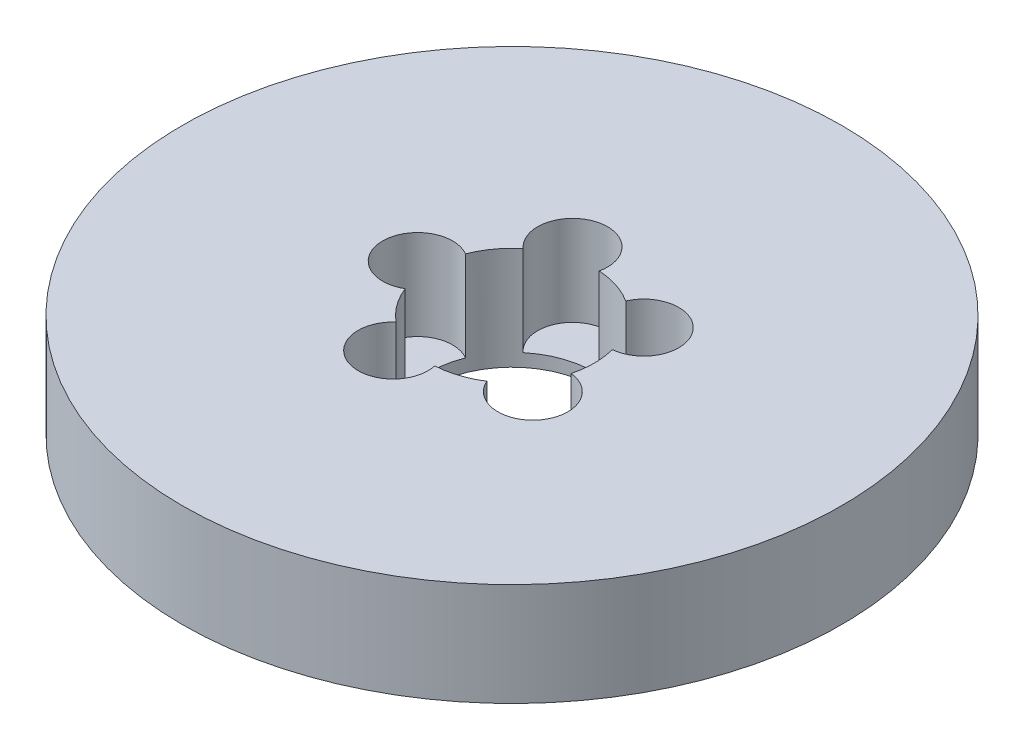
ISO-10303-21;
HEADER;
FILE_DESCRIPTION(('STEP AP214'),'2;1');
FILE_NAME('part.step','',(''),(''),'','','');
FILE_SCHEMA(('AUTOMOTIVE_DESIGN { 1 0 10303 214 1 1 1 1 }'));
ENDSEC;
DATA;
#1=APPLICATION_CONTEXT('core data for automotive mechanical design processes');
#2=APPLICATION_PROTOCOL_DEFINITION('international standard','automotive_design',2000,#1);
#3=PRODUCT_CONTEXT('',#1,'mechanical');
#4=PRODUCT('Part','Part','',(#3));
#5=PRODUCT_RELATED_PRODUCT_CATEGORY('part','',(#4));
#6=PRODUCT_DEFINITION_FORMATION('','',#4);
#7=PRODUCT_DEFINITION_CONTEXT('part definition',#1,'design');
#8=PRODUCT_DEFINITION('design','',#6,#7);
#9=PRODUCT_DEFINITION_SHAPE('','',#8);
#10=(LENGTH_UNIT() NAMED_UNIT(*) SI_UNIT(.MILLI.,.METRE.));
#11=(NAMED_UNIT(*) PLANE_ANGLE_UNIT() SI_UNIT($,.RADIAN.));
#12=(NAMED_UNIT(*) SI_UNIT($,.STERADIAN.) SOLID_ANGLE_UNIT());
#13=UNCERTAINTY_MEASURE_WITH_UNIT(LENGTH_MEASURE(1.E-05),#10,'distance_accuracy_value','');
#14=(GEOMETRIC_REPRESENTATION_CONTEXT(3) GLOBAL_UNCERTAINTY_ASSIGNED_CONTEXT((#13)) GLOBAL_UNIT_ASSIGNED_CONTEXT((#10,
#11,#12)) REPRESENTATION_CONTEXT('',''));
#15=CARTESIAN_POINT('',(0.,0.,0.));
#16=DIRECTION('',(0.,0.,1.));
#17=DIRECTION('',(1.,0.,0.));
#18=AXIS2_PLACEMENT_3D('',#15,#16,#17);
#19=CARTESIAN_POINT('',(0.,25.,0.));
#20=DIRECTION('',(0.,-1.,0.));
#21=DIRECTION('',(0.,0.,-1.));
#22=AXIS2_PLACEMENT_3D('',#19,#20,#21);
#23=CYLINDRICAL_SURFACE('',#22,80.);
#24=CARTESIAN_POINT('',(0.,25.,0.));
#25=DIRECTION('',(0.,1.,0.));
#26=DIRECTION('',(0.,0.,1.));
#27=AXIS2_PLACEMENT_3D('',#24,#25,#26);
#28=CIRCLE('',#27,80.);
#29=CARTESIAN_POINT('',(0.,25.,80.));
#30=VERTEX_POINT('',#29);
#31=EDGE_CURVE('E157',#30,#30,#28,.T.);
#32=ORIENTED_EDGE('',*,*,#31,.F.);
#33=EDGE_LOOP('',(#32));
#34=FACE_BOUND('',#33,.T.);
#35=CARTESIAN_POINT('',(0.,0.,0.));
#36=DIRECTION('',(0.,1.,0.));
#37=DIRECTION('',(0.,0.,1.));
#38=AXIS2_PLACEMENT_3D('',#35,#36,#37);
#39=CIRCLE('',#38,80.);
#40=CARTESIAN_POINT('',(0.,0.,80.));
#41=VERTEX_POINT('',#40);
#42=EDGE_CURVE('E150',#41,#41,#39,.T.);
#43=ORIENTED_EDGE('',*,*,#42,.T.);
#44=EDGE_LOOP('',(#43));
#45=FACE_BOUND('',#44,.T.);
#46=ADVANCED_FACE('F39',(#34,#45),#23,.T.);
#47=CARTESIAN_POINT('',(0.,25.,0.));
#48=DIRECTION('',(0.,1.,0.));
#49=DIRECTION('',(0.,0.,1.));
#50=AXIS2_PLACEMENT_3D('',#47,#48,#49);
#51=PLANE('',#50);
#52=CARTESIAN_POINT('',(-7.07870051810145,25.,-21.7860000491539));
#53=DIRECTION('',(0.,1.,0.));
#54=DIRECTION('',(-0.95105651629515,0.,0.309016994374958));
#55=AXIS2_PLACEMENT_3D('',#52,#53,#54);
#56=CIRCLE('',#55,8.48917629598896);
#57=CARTESIAN_POINT('',(1.21247338873536,25.,-19.9632138765683));
#58=VERTEX_POINT('',#57);
#59=CARTESIAN_POINT('',(-12.7149942817219,25.,-15.4379053117895));
#60=VERTEX_POINT('',#59);
#61=EDGE_CURVE('E194',#58,#60,#56,.T.);
#62=ORIENTED_EDGE('',*,*,#61,.F.);
#63=CARTESIAN_POINT('',(0.,25.,0.));
#64=DIRECTION('',(0.,1.,0.));
#65=DIRECTION('',(0.,0.,1.));
#66=AXIS2_PLACEMENT_3D('',#63,#64,#65);
#67=CIRCLE('',#66,20.);
#68=CARTESIAN_POINT('',(10.7531711282927,25.,-16.8632532651815));
#69=VERTEX_POINT('',#68);
#70=EDGE_CURVE('E147',#69,#58,#67,.T.);
#71=ORIENTED_EDGE('',*,*,#70,.F.);
#72=CARTESIAN_POINT('',(18.5322785525703,25.,-13.4644885092842));
#73=DIRECTION('',(0.,1.,0.));
#74=DIRECTION('',(-0.58778525229248,0.,-0.809016994374942));
#75=AXIS2_PLACEMENT_3D('',#72,#73,#74);
#76=CIRCLE('',#75,8.48917629598896);
#77=CARTESIAN_POINT('',(19.3608195258507,25.,-5.0158416330101));
#78=VERTEX_POINT('',#77);
#79=EDGE_CURVE('E254',#78,#69,#76,.T.);
#80=ORIENTED_EDGE('',*,*,#79,.F.);
#81=CARTESIAN_POINT('',(19.3608195258508,25.,5.01584163300982));
#82=VERTEX_POINT('',#81);
#83=EDGE_CURVE('E144',#82,#78,#67,.T.);
#84=ORIENTED_EDGE('',*,*,#83,.F.);
#85=CARTESIAN_POINT('',(18.5322785525705,25.,13.4644885092839));
#86=DIRECTION('',(0.,1.,0.));
#87=DIRECTION('',(0.587785252292469,0.,-0.809016994374951));
#88=AXIS2_PLACEMENT_3D('',#85,#86,#87);
#89=CIRCLE('',#88,8.48917629598896);
#90=CARTESIAN_POINT('',(10.7531711282929,25.,16.8632532651813));
#91=VERTEX_POINT('',#90);
#92=EDGE_CURVE('E141',#91,#82,#89,.T.);
#93=ORIENTED_EDGE('',*,*,#92,.F.);
#94=CARTESIAN_POINT('',(1.21247338873564,25.,19.9632138765683));
#95=VERTEX_POINT('',#94);
#96=EDGE_CURVE('E134',#95,#91,#67,.T.);
#97=ORIENTED_EDGE('',*,*,#96,.F.);
#98=CARTESIAN_POINT('',(-7.07870051810114,25.,21.786000049154));
#99=DIRECTION('',(0.,1.,0.));
#100=DIRECTION('',(0.951056516295155,0.,0.309016994374945));
#101=AXIS2_PLACEMENT_3D('',#98,#99,#100);
#102=CIRCLE('',#101,8.48917629598896);
#103=CARTESIAN_POINT('',(-12.7149942817217,25.,15.4379053117897));
#104=VERTEX_POINT('',#103);
#105=EDGE_CURVE('E111',#104,#95,#102,.T.);
#106=ORIENTED_EDGE('',*,*,#105,.F.);
#107=CARTESIAN_POINT('',(-18.6114697611574,25.,7.32210306739282));
#108=VERTEX_POINT('',#107);
#109=EDGE_CURVE('E145',#108,#104,#67,.T.);
#110=ORIENTED_EDGE('',*,*,#109,.F.);
#111=CARTESIAN_POINT('',(-22.9071560689385,25.,0.));
#112=DIRECTION('',(0.,1.,0.));
#113=DIRECTION('',(0.,0.,1.));
#114=AXIS2_PLACEMENT_3D('',#111,#112,#113);
#115=CIRCLE('',#114,8.48917629598896);
#116=CARTESIAN_POINT('',(-18.6114697611574,25.,-7.32210306739282));
#117=VERTEX_POINT('',#116);
#118=EDGE_CURVE('E153',#117,#108,#115,.T.);
#119=ORIENTED_EDGE('',*,*,#118,.F.);
#120=EDGE_CURVE('E146',#60,#117,#67,.T.);
#121=ORIENTED_EDGE('',*,*,#120,.F.);
#122=EDGE_LOOP('',(#62,#71,#80,#84,#93,#97,#106,#110,#119,#121));
#123=FACE_BOUND('',#122,.T.);
#124=ORIENTED_EDGE('',*,*,#31,.T.);
#125=EDGE_LOOP('',(#124));
#126=FACE_BOUND('',#125,.T.);
#127=ADVANCED_FACE('F139',(#123,#126),#51,.T.);
#128=CARTESIAN_POINT('',(0.,0.,0.));
#129=DIRECTION('',(0.,1.,0.));
#130=DIRECTION('',(0.,0.,1.));
#131=AXIS2_PLACEMENT_3D('',#128,#129,#130);
#132=PLANE('',#131);
#133=CARTESIAN_POINT('',(0.,0.,0.));
#134=DIRECTION('',(0.,1.,0.));
#135=DIRECTION('',(0.,0.,1.));
#136=AXIS2_PLACEMENT_3D('',#133,#134,#135);
#137=CIRCLE('',#136,20.);
#138=CARTESIAN_POINT('',(0.,0.,20.));
#139=VERTEX_POINT('',#138);
#140=EDGE_CURVE('E154',#139,#139,#137,.T.);
#141=ORIENTED_EDGE('',*,*,#140,.T.);
#142=EDGE_LOOP('',(#141));
#143=FACE_BOUND('',#142,.T.);
#144=ORIENTED_EDGE('',*,*,#42,.F.);
#145=EDGE_LOOP('',(#144));
#146=FACE_BOUND('',#145,.T.);
#147=ADVANCED_FACE('F213',(#143,#146),#132,.F.);
#148=CARTESIAN_POINT('',(0.,25.,0.));
#149=DIRECTION('',(0.,-1.,0.));
#150=DIRECTION('',(0.,0.,-1.));
#151=AXIS2_PLACEMENT_3D('',#148,#149,#150);
#152=CYLINDRICAL_SURFACE('',#151,20.);
#153=DIRECTION('',(0.,1.,0.));
#154=VECTOR('',#153,1.);
#155=CARTESIAN_POINT('',(1.21247338873536,14.0648096940032,-19.9632138765683));
#156=LINE('',#155,#154);
#157=CARTESIAN_POINT('',(1.21247338873536,3.12961938800646,-19.9632138765683));
#158=VERTEX_POINT('',#157);
#159=EDGE_CURVE('E11',#158,#58,#156,.T.);
#160=ORIENTED_EDGE('',*,*,#159,.F.);
#161=CARTESIAN_POINT('',(0.,3.12961938800646,0.));
#162=DIRECTION('',(0.,1.,0.));
#163=DIRECTION('',(0.,0.,1.));
#164=AXIS2_PLACEMENT_3D('',#161,#162,#163);
#165=CIRCLE('',#164,20.);
#166=CARTESIAN_POINT('',(-12.7149942817219,3.12961938800646,-15.4379053117895));
#167=VERTEX_POINT('',#166);
#168=EDGE_CURVE('E189',#158,#167,#165,.T.);
#169=ORIENTED_EDGE('',*,*,#168,.T.);
#170=DIRECTION('',(0.,1.,0.));
#171=VECTOR('',#170,1.);
#172=CARTESIAN_POINT('',(-12.7149942817219,14.0648096940032,-15.4379053117895));
#173=LINE('',#172,#171);
#174=EDGE_CURVE('E46',#60,#167,#173,.F.);
#175=ORIENTED_EDGE('',*,*,#174,.F.);
#176=ORIENTED_EDGE('',*,*,#120,.T.);
#177=DIRECTION('',(0.,1.,0.));
#178=VECTOR('',#177,1.);
#179=CARTESIAN_POINT('',(-18.6114697611574,14.0648096940032,-7.32210306739282));
#180=LINE('',#179,#178);
#181=CARTESIAN_POINT('',(-18.6114697611574,3.12961938800646,-7.32210306739282));
#182=VERTEX_POINT('',#181);
#183=EDGE_CURVE('E168',#182,#117,#180,.T.);
#184=ORIENTED_EDGE('',*,*,#183,.F.);
#185=CARTESIAN_POINT('',(0.,3.12961938800646,0.));
#186=DIRECTION('',(0.,1.,0.));
#187=DIRECTION('',(0.,0.,1.));
#188=AXIS2_PLACEMENT_3D('',#185,#186,#187);
#189=CIRCLE('',#188,20.);
#190=CARTESIAN_POINT('',(-18.6114697611574,3.12961938800646,7.32210306739282));
#191=VERTEX_POINT('',#190);
#192=EDGE_CURVE('E165',#182,#191,#189,.T.);
#193=ORIENTED_EDGE('',*,*,#192,.T.);
#194=DIRECTION('',(0.,1.,0.));
#195=VECTOR('',#194,1.);
#196=CARTESIAN_POINT('',(-18.6114697611574,14.0648096940032,7.32210306739282));
#197=LINE('',#196,#195);
#198=EDGE_CURVE('E170',#108,#191,#197,.F.);
#199=ORIENTED_EDGE('',*,*,#198,.F.);
#200=ORIENTED_EDGE('',*,*,#109,.T.);
#201=DIRECTION('',(0.,1.,0.));
#202=VECTOR('',#201,1.);
#203=CARTESIAN_POINT('',(-12.7149942817217,14.0648096940032,15.4379053117897));
#204=LINE('',#203,#202);
#205=CARTESIAN_POINT('',(-12.7149942817217,3.12961938800646,15.4379053117897));
#206=VERTEX_POINT('',#205);
#207=EDGE_CURVE('E121',#206,#104,#204,.T.);
#208=ORIENTED_EDGE('',*,*,#207,.F.);
#209=CARTESIAN_POINT('',(0.,3.12961938800646,0.));
#210=DIRECTION('',(0.,1.,0.));
#211=DIRECTION('',(0.,0.,1.));
#212=AXIS2_PLACEMENT_3D('',#209,#210,#211);
#213=CIRCLE('',#212,20.);
#214=CARTESIAN_POINT('',(1.21247338873564,3.12961938800646,19.9632138765683));
#215=VERTEX_POINT('',#214);
#216=EDGE_CURVE('E136',#206,#215,#213,.T.);
#217=ORIENTED_EDGE('',*,*,#216,.T.);
#218=DIRECTION('',(0.,1.,0.));
#219=VECTOR('',#218,1.);
#220=CARTESIAN_POINT('',(1.21247338873564,14.0648096940032,19.9632138765683));
#221=LINE('',#220,#219);
#222=EDGE_CURVE('E117',#95,#215,#221,.F.);
#223=ORIENTED_EDGE('',*,*,#222,.F.);
#224=ORIENTED_EDGE('',*,*,#96,.T.);
#225=DIRECTION('',(0.,1.,0.));
#226=VECTOR('',#225,1.);
#227=CARTESIAN_POINT('',(10.7531711282929,14.0648096940032,16.8632532651813));
#228=LINE('',#227,#226);
#229=CARTESIAN_POINT('',(10.7531711282929,3.12961938800646,16.8632532651813));
#230=VERTEX_POINT('',#229);
#231=EDGE_CURVE('E182',#230,#91,#228,.T.);
#232=ORIENTED_EDGE('',*,*,#231,.F.);
#233=CARTESIAN_POINT('',(0.,3.12961938800646,0.));
#234=DIRECTION('',(0.,1.,0.));
#235=DIRECTION('',(0.,0.,1.));
#236=AXIS2_PLACEMENT_3D('',#233,#234,#235);
#237=CIRCLE('',#236,20.);
#238=CARTESIAN_POINT('',(19.3608195258508,3.12961938800646,5.01584163300982));
#239=VERTEX_POINT('',#238);
#240=EDGE_CURVE('E174',#230,#239,#237,.T.);
#241=ORIENTED_EDGE('',*,*,#240,.T.);
#242=DIRECTION('',(0.,1.,0.));
#243=VECTOR('',#242,1.);
#244=CARTESIAN_POINT('',(19.3608195258508,14.0648096940032,5.01584163300982));
#245=LINE('',#244,#243);
#246=EDGE_CURVE('E177',#82,#239,#245,.F.);
#247=ORIENTED_EDGE('',*,*,#246,.F.);
#248=ORIENTED_EDGE('',*,*,#83,.T.);
#249=DIRECTION('',(0.,1.,0.));
#250=VECTOR('',#249,1.);
#251=CARTESIAN_POINT('',(19.3608195258507,14.0648096940032,-5.0158416330101));
#252=LINE('',#251,#250);
#253=CARTESIAN_POINT('',(19.3608195258507,3.12961938800646,-5.0158416330101));
#254=VERTEX_POINT('',#253);
#255=EDGE_CURVE('E187',#254,#78,#252,.T.);
#256=ORIENTED_EDGE('',*,*,#255,.F.);
#257=CARTESIAN_POINT('',(0.,3.12961938800646,0.));
#258=DIRECTION('',(0.,1.,0.));
#259=DIRECTION('',(0.,0.,1.));
#260=AXIS2_PLACEMENT_3D('',#257,#258,#259);
#261=CIRCLE('',#260,20.);
#262=CARTESIAN_POINT('',(10.7531711282927,3.12961938800646,-16.8632532651815));
#263=VERTEX_POINT('',#262);
#264=EDGE_CURVE('E181',#254,#263,#261,.T.);
#265=ORIENTED_EDGE('',*,*,#264,.T.);
#266=DIRECTION('',(0.,1.,0.));
#267=VECTOR('',#266,1.);
#268=CARTESIAN_POINT('',(10.7531711282927,14.0648096940032,-16.8632532651815));
#269=LINE('',#268,#267);
#270=EDGE_CURVE('E186',#69,#263,#269,.F.);
#271=ORIENTED_EDGE('',*,*,#270,.F.);
#272=ORIENTED_EDGE('',*,*,#70,.T.);
#273=EDGE_LOOP('',(#160,#169,#175,#176,#184,#193,#199,#200,#208,#217,#223,#224,#232,#241,#247,
#248,#256,#265,#271,#272));
#274=FACE_BOUND('',#273,.T.);
#275=ORIENTED_EDGE('',*,*,#140,.F.);
#276=EDGE_LOOP('',(#275));
#277=FACE_BOUND('',#276,.T.);
#278=ADVANCED_FACE('F135',(#274,#277),#152,.F.);
#279=CARTESIAN_POINT('',(-22.9071560689385,3.12961938800646,0.));
#280=DIRECTION('',(0.,1.,0.));
#281=DIRECTION('',(0.,0.,1.));
#282=AXIS2_PLACEMENT_3D('',#279,#280,#281);
#283=CYLINDRICAL_SURFACE('',#282,8.48917629598896);
#284=ORIENTED_EDGE('',*,*,#183,.T.);
#285=ORIENTED_EDGE('',*,*,#118,.T.);
#286=ORIENTED_EDGE('',*,*,#198,.T.);
#287=CARTESIAN_POINT('',(-22.9071560689385,3.12961938800646,0.));
#288=DIRECTION('',(0.,1.,0.));
#289=DIRECTION('',(0.,0.,1.));
#290=AXIS2_PLACEMENT_3D('',#287,#288,#289);
#291=CIRCLE('',#290,8.48917629598896);
#292=EDGE_CURVE('E158',#182,#191,#291,.T.);
#293=ORIENTED_EDGE('',*,*,#292,.F.);
#294=EDGE_LOOP('',(#284,#285,#286,#293));
#295=FACE_BOUND('',#294,.T.);
#296=ADVANCED_FACE('F221',(#295),#283,.F.);
#297=CARTESIAN_POINT('',(-22.9071560689385,3.12961938800646,0.));
#298=DIRECTION('',(0.,1.,0.));
#299=DIRECTION('',(0.,0.,1.));
#300=AXIS2_PLACEMENT_3D('',#297,#298,#299);
#301=PLANE('',#300);
#302=ORIENTED_EDGE('',*,*,#292,.T.);
#303=ORIENTED_EDGE('',*,*,#192,.F.);
#304=EDGE_LOOP('',(#302,#303));
#305=FACE_BOUND('',#304,.T.);
#306=ADVANCED_FACE('F227',(#305),#301,.T.);
#307=CARTESIAN_POINT('',(-7.07870051810114,3.12961938800646,21.786000049154));
#308=DIRECTION('',(0.,1.,0.));
#309=DIRECTION('',(0.,0.,1.));
#310=AXIS2_PLACEMENT_3D('',#307,#308,#309);
#311=CYLINDRICAL_SURFACE('',#310,8.48917629598896);
#312=ORIENTED_EDGE('',*,*,#207,.T.);
#313=ORIENTED_EDGE('',*,*,#105,.T.);
#314=ORIENTED_EDGE('',*,*,#222,.T.);
#315=CARTESIAN_POINT('',(-7.07870051810114,3.12961938800646,21.786000049154));
#316=DIRECTION('',(0.,1.,0.));
#317=DIRECTION('',(0.951056516295155,0.,0.309016994374945));
#318=AXIS2_PLACEMENT_3D('',#315,#316,#317);
#319=CIRCLE('',#318,8.48917629598896);
#320=EDGE_CURVE('E127',#206,#215,#319,.T.);
#321=ORIENTED_EDGE('',*,*,#320,.F.);
#322=EDGE_LOOP('',(#312,#313,#314,#321));
#323=FACE_BOUND('',#322,.T.);
#324=ADVANCED_FACE('F116',(#323),#311,.F.);
#325=CARTESIAN_POINT('',(-7.07870051810114,3.12961938800646,21.786000049154));
#326=DIRECTION('',(0.,1.,0.));
#327=DIRECTION('',(0.951056516295155,0.,0.309016994374945));
#328=AXIS2_PLACEMENT_3D('',#325,#326,#327);
#329=PLANE('',#328);
#330=ORIENTED_EDGE('',*,*,#320,.T.);
#331=ORIENTED_EDGE('',*,*,#216,.F.);
#332=EDGE_LOOP('',(#330,#331));
#333=FACE_BOUND('',#332,.T.);
#334=ADVANCED_FACE('F234',(#333),#329,.T.);
#335=CARTESIAN_POINT('',(18.5322785525705,3.12961938800646,13.4644885092839));
#336=DIRECTION('',(0.,1.,0.));
#337=DIRECTION('',(0.,0.,1.));
#338=AXIS2_PLACEMENT_3D('',#335,#336,#337);
#339=CYLINDRICAL_SURFACE('',#338,8.48917629598896);
#340=ORIENTED_EDGE('',*,*,#231,.T.);
#341=ORIENTED_EDGE('',*,*,#92,.T.);
#342=ORIENTED_EDGE('',*,*,#246,.T.);
#343=CARTESIAN_POINT('',(18.5322785525705,3.12961938800646,13.4644885092839));
#344=DIRECTION('',(0.,1.,0.));
#345=DIRECTION('',(0.587785252292469,0.,-0.809016994374951));
#346=AXIS2_PLACEMENT_3D('',#343,#344,#345);
#347=CIRCLE('',#346,8.48917629598896);
#348=EDGE_CURVE('E130',#230,#239,#347,.T.);
#349=ORIENTED_EDGE('',*,*,#348,.F.);
#350=EDGE_LOOP('',(#340,#341,#342,#349));
#351=FACE_BOUND('',#350,.T.);
#352=ADVANCED_FACE('F240',(#351),#339,.F.);
#353=CARTESIAN_POINT('',(18.5322785525705,3.12961938800646,13.4644885092839));
#354=DIRECTION('',(0.,1.,0.));
#355=DIRECTION('',(0.587785252292469,0.,-0.809016994374951));
#356=AXIS2_PLACEMENT_3D('',#353,#354,#355);
#357=PLANE('',#356);
#358=ORIENTED_EDGE('',*,*,#348,.T.);
#359=ORIENTED_EDGE('',*,*,#240,.F.);
#360=EDGE_LOOP('',(#358,#359));
#361=FACE_BOUND('',#360,.T.);
#362=ADVANCED_FACE('F245',(#361),#357,.T.);
#363=CARTESIAN_POINT('',(18.5322785525703,3.12961938800646,-13.4644885092842));
#364=DIRECTION('',(0.,1.,0.));
#365=DIRECTION('',(0.,0.,1.));
#366=AXIS2_PLACEMENT_3D('',#363,#364,#365);
#367=CYLINDRICAL_SURFACE('',#366,8.48917629598896);
#368=ORIENTED_EDGE('',*,*,#255,.T.);
#369=ORIENTED_EDGE('',*,*,#79,.T.);
#370=ORIENTED_EDGE('',*,*,#270,.T.);
#371=CARTESIAN_POINT('',(18.5322785525703,3.12961938800646,-13.4644885092842));
#372=DIRECTION('',(0.,1.,0.));
#373=DIRECTION('',(-0.58778525229248,0.,-0.809016994374942));
#374=AXIS2_PLACEMENT_3D('',#371,#372,#373);
#375=CIRCLE('',#374,8.48917629598896);
#376=EDGE_CURVE('E56',#254,#263,#375,.T.);
#377=ORIENTED_EDGE('',*,*,#376,.F.);
#378=EDGE_LOOP('',(#368,#369,#370,#377));
#379=FACE_BOUND('',#378,.T.);
#380=ADVANCED_FACE('F266',(#379),#367,.F.);
#381=CARTESIAN_POINT('',(18.5322785525703,3.12961938800646,-13.4644885092842));
#382=DIRECTION('',(0.,1.,0.));
#383=DIRECTION('',(-0.58778525229248,0.,-0.809016994374942));
#384=AXIS2_PLACEMENT_3D('',#381,#382,#383);
#385=PLANE('',#384);
#386=ORIENTED_EDGE('',*,*,#376,.T.);
#387=ORIENTED_EDGE('',*,*,#264,.F.);
#388=EDGE_LOOP('',(#386,#387));
#389=FACE_BOUND('',#388,.T.);
#390=ADVANCED_FACE('F204',(#389),#385,.T.);
#391=CARTESIAN_POINT('',(-7.07870051810145,3.12961938800646,-21.7860000491539));
#392=DIRECTION('',(0.,1.,0.));
#393=DIRECTION('',(0.,0.,1.));
#394=AXIS2_PLACEMENT_3D('',#391,#392,#393);
#395=CYLINDRICAL_SURFACE('',#394,8.48917629598896);
#396=ORIENTED_EDGE('',*,*,#159,.T.);
#397=ORIENTED_EDGE('',*,*,#61,.T.);
#398=ORIENTED_EDGE('',*,*,#174,.T.);
#399=CARTESIAN_POINT('',(-7.07870051810145,3.12961938800646,-21.7860000491539));
#400=DIRECTION('',(0.,1.,0.));
#401=DIRECTION('',(-0.95105651629515,0.,0.309016994374958));
#402=AXIS2_PLACEMENT_3D('',#399,#400,#401);
#403=CIRCLE('',#402,8.48917629598896);
#404=EDGE_CURVE('E55',#158,#167,#403,.T.);
#405=ORIENTED_EDGE('',*,*,#404,.F.);
#406=EDGE_LOOP('',(#396,#397,#398,#405));
#407=FACE_BOUND('',#406,.T.);
#408=ADVANCED_FACE('F193',(#407),#395,.F.);
#409=CARTESIAN_POINT('',(-7.07870051810145,3.12961938800646,-21.7860000491539));
#410=DIRECTION('',(0.,1.,0.));
#411=DIRECTION('',(-0.95105651629515,0.,0.309016994374958));
#412=AXIS2_PLACEMENT_3D('',#409,#410,#411);
#413=PLANE('',#412);
#414=ORIENTED_EDGE('',*,*,#404,.T.);
#415=ORIENTED_EDGE('',*,*,#168,.F.);
#416=EDGE_LOOP('',(#414,#415));
#417=FACE_BOUND('',#416,.T.);
#418=ADVANCED_FACE('F196',(#417),#413,.T.);
#419=CLOSED_SHELL('',(#46,#127,#147,#278,#296,#306,#324,#334,#352,#362,#380,#390,#408,#418));
#420=MANIFOLD_SOLID_BREP('B2',#419);
#421=ADVANCED_BREP_SHAPE_REPRESENTATION('',(#18,#420),#14);
#422=SHAPE_DEFINITION_REPRESENTATION(#9,#421);
ENDSEC;
END-ISO-10303-21;
